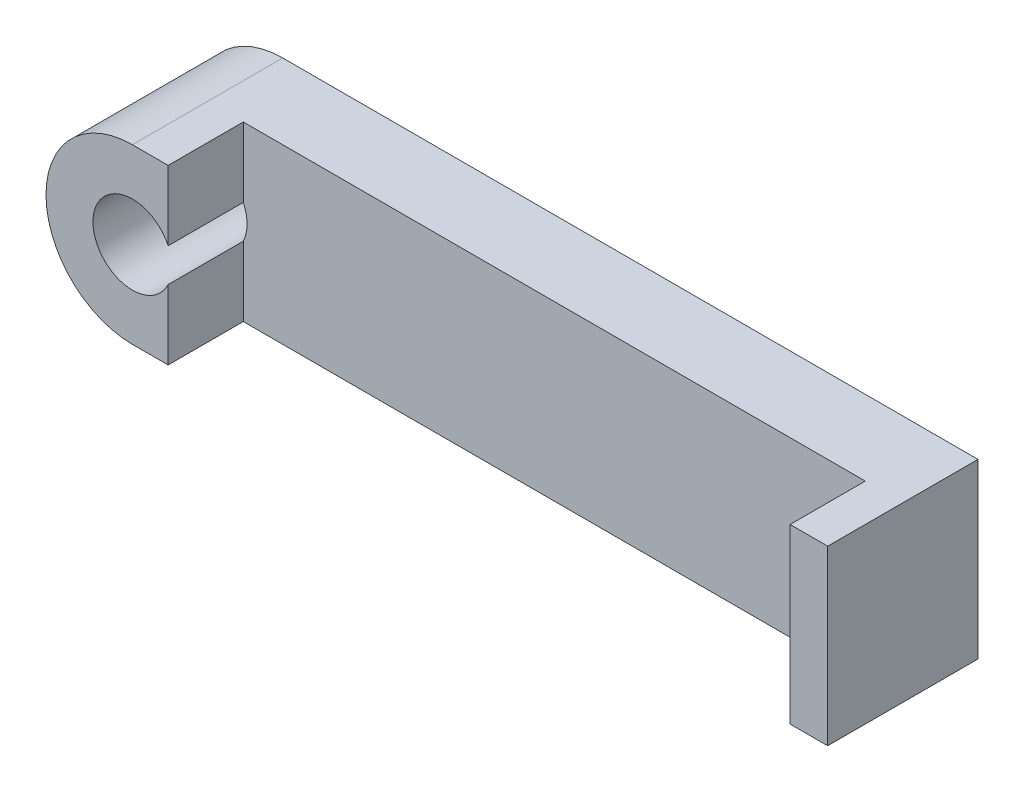
ISO-10303-21;
HEADER;
FILE_DESCRIPTION(('STEP AP214'),'2;1');
FILE_NAME('part.step','',(''),(''),'','','');
FILE_SCHEMA(('AUTOMOTIVE_DESIGN { 1 0 10303 214 1 1 1 1 }'));
ENDSEC;
DATA;
#1=APPLICATION_CONTEXT('core data for automotive mechanical design processes');
#2=APPLICATION_PROTOCOL_DEFINITION('international standard','automotive_design',2000,#1);
#3=PRODUCT_CONTEXT('',#1,'mechanical');
#4=PRODUCT('Part','Part','',(#3));
#5=PRODUCT_RELATED_PRODUCT_CATEGORY('part','',(#4));
#6=PRODUCT_DEFINITION_FORMATION('','',#4);
#7=PRODUCT_DEFINITION_CONTEXT('part definition',#1,'design');
#8=PRODUCT_DEFINITION('design','',#6,#7);
#9=PRODUCT_DEFINITION_SHAPE('','',#8);
#10=(LENGTH_UNIT() NAMED_UNIT(*) SI_UNIT(.MILLI.,.METRE.));
#11=(NAMED_UNIT(*) PLANE_ANGLE_UNIT() SI_UNIT($,.RADIAN.));
#12=(NAMED_UNIT(*) SI_UNIT($,.STERADIAN.) SOLID_ANGLE_UNIT());
#13=UNCERTAINTY_MEASURE_WITH_UNIT(LENGTH_MEASURE(1.E-05),#10,'distance_accuracy_value','');
#14=(GEOMETRIC_REPRESENTATION_CONTEXT(3) GLOBAL_UNCERTAINTY_ASSIGNED_CONTEXT((#13)) GLOBAL_UNIT_ASSIGNED_CONTEXT((#10,
#11,#12)) REPRESENTATION_CONTEXT('',''));
#15=CARTESIAN_POINT('',(0.,0.,0.));
#16=DIRECTION('',(0.,0.,1.));
#17=DIRECTION('',(1.,0.,0.));
#18=AXIS2_PLACEMENT_3D('',#15,#16,#17);
#19=CARTESIAN_POINT('',(0.,0.,4.));
#20=DIRECTION('',(0.,0.,1.));
#21=DIRECTION('',(1.,0.,0.));
#22=AXIS2_PLACEMENT_3D('',#19,#20,#21);
#23=PLANE('',#22);
#24=DIRECTION('',(0.,1.,0.));
#25=VECTOR('',#24,1.);
#26=CARTESIAN_POINT('',(1.9,4.6,4.));
#27=LINE('',#26,#25);
#28=CARTESIAN_POINT('',(1.9,0.894427190999917,4.));
#29=VERTEX_POINT('',#28);
#30=CARTESIAN_POINT('',(1.9,4.6,4.));
#31=VERTEX_POINT('',#30);
#32=EDGE_CURVE('E56',#29,#31,#27,.T.);
#33=ORIENTED_EDGE('',*,*,#32,.F.);
#34=CARTESIAN_POINT('',(0.,0.,4.));
#35=DIRECTION('',(0.,0.,1.));
#36=DIRECTION('',(1.,0.,0.));
#37=AXIS2_PLACEMENT_3D('',#34,#35,#36);
#38=CIRCLE('',#37,2.1);
#39=CARTESIAN_POINT('',(1.9,-0.894427190999916,4.));
#40=VERTEX_POINT('',#39);
#41=EDGE_CURVE('E179',#40,#29,#38,.T.);
#42=ORIENTED_EDGE('',*,*,#41,.F.);
#43=DIRECTION('',(0.,1.,0.));
#44=VECTOR('',#43,1.);
#45=CARTESIAN_POINT('',(1.9,-0.894427190999916,4.));
#46=LINE('',#45,#44);
#47=CARTESIAN_POINT('',(1.9,-4.6,4.));
#48=VERTEX_POINT('',#47);
#49=EDGE_CURVE('E138',#48,#40,#46,.T.);
#50=ORIENTED_EDGE('',*,*,#49,.F.);
#51=DIRECTION('',(1.,0.,0.));
#52=VECTOR('',#51,1.);
#53=CARTESIAN_POINT('',(37.,-4.6,4.));
#54=LINE('',#53,#52);
#55=CARTESIAN_POINT('',(35.,-4.6,4.));
#56=VERTEX_POINT('',#55);
#57=EDGE_CURVE('E183',#48,#56,#54,.T.);
#58=ORIENTED_EDGE('',*,*,#57,.T.);
#59=DIRECTION('',(0.,-1.,0.));
#60=VECTOR('',#59,1.);
#61=CARTESIAN_POINT('',(35.,4.6,4.));
#62=LINE('',#61,#60);
#63=CARTESIAN_POINT('',(35.,4.6,4.));
#64=VERTEX_POINT('',#63);
#65=EDGE_CURVE('E149',#64,#56,#62,.T.);
#66=ORIENTED_EDGE('',*,*,#65,.F.);
#67=DIRECTION('',(-1.,0.,0.));
#68=VECTOR('',#67,1.);
#69=CARTESIAN_POINT('',(0.,4.6,4.));
#70=LINE('',#69,#68);
#71=EDGE_CURVE('E61',#64,#31,#70,.T.);
#72=ORIENTED_EDGE('',*,*,#71,.T.);
#73=EDGE_LOOP('',(#33,#42,#50,#58,#66,#72));
#74=FACE_BOUND('',#73,.T.);
#75=ADVANCED_FACE('F41',(#74),#23,.T.);
#76=CARTESIAN_POINT('',(0.,0.,0.));
#77=DIRECTION('',(0.,0.,1.));
#78=DIRECTION('',(1.,0.,0.));
#79=AXIS2_PLACEMENT_3D('',#76,#77,#78);
#80=PLANE('',#79);
#81=CARTESIAN_POINT('',(0.,0.,0.));
#82=DIRECTION('',(0.,0.,1.));
#83=DIRECTION('',(1.,0.,0.));
#84=AXIS2_PLACEMENT_3D('',#81,#82,#83);
#85=CIRCLE('',#84,4.6);
#86=CARTESIAN_POINT('',(0.,4.6,0.));
#87=VERTEX_POINT('',#86);
#88=CARTESIAN_POINT('',(0.,-4.6,0.));
#89=VERTEX_POINT('',#88);
#90=EDGE_CURVE('E121',#87,#89,#85,.T.);
#91=ORIENTED_EDGE('',*,*,#90,.F.);
#92=DIRECTION('',(-1.,0.,0.));
#93=VECTOR('',#92,1.);
#94=CARTESIAN_POINT('',(0.,4.6,0.));
#95=LINE('',#94,#93);
#96=CARTESIAN_POINT('',(37.,4.6,0.));
#97=VERTEX_POINT('',#96);
#98=EDGE_CURVE('E185',#97,#87,#95,.T.);
#99=ORIENTED_EDGE('',*,*,#98,.F.);
#100=DIRECTION('',(0.,1.,0.));
#101=VECTOR('',#100,1.);
#102=CARTESIAN_POINT('',(37.,4.6,0.));
#103=LINE('',#102,#101);
#104=CARTESIAN_POINT('',(37.,-4.6,0.));
#105=VERTEX_POINT('',#104);
#106=EDGE_CURVE('E191',#105,#97,#103,.T.);
#107=ORIENTED_EDGE('',*,*,#106,.F.);
#108=DIRECTION('',(1.,0.,0.));
#109=VECTOR('',#108,1.);
#110=CARTESIAN_POINT('',(37.,-4.6,0.));
#111=LINE('',#110,#109);
#112=EDGE_CURVE('E189',#89,#105,#111,.T.);
#113=ORIENTED_EDGE('',*,*,#112,.F.);
#114=EDGE_LOOP('',(#91,#99,#107,#113));
#115=FACE_BOUND('',#114,.T.);
#116=CARTESIAN_POINT('',(0.,0.,0.));
#117=DIRECTION('',(0.,0.,1.));
#118=DIRECTION('',(1.,0.,0.));
#119=AXIS2_PLACEMENT_3D('',#116,#117,#118);
#120=CIRCLE('',#119,2.1);
#121=CARTESIAN_POINT('',(2.1,0.,0.));
#122=VERTEX_POINT('',#121);
#123=EDGE_CURVE('E160',#122,#122,#120,.T.);
#124=ORIENTED_EDGE('',*,*,#123,.T.);
#125=EDGE_LOOP('',(#124));
#126=FACE_BOUND('',#125,.T.);
#127=ADVANCED_FACE('F205',(#115,#126),#80,.F.);
#128=CARTESIAN_POINT('',(0.,0.,4.));
#129=DIRECTION('',(0.,0.,-1.));
#130=DIRECTION('',(-1.,0.,0.));
#131=AXIS2_PLACEMENT_3D('',#128,#129,#130);
#132=CYLINDRICAL_SURFACE('',#131,4.6);
#133=ORIENTED_EDGE('',*,*,#90,.T.);
#134=DIRECTION('',(0.,0.,-1.));
#135=VECTOR('',#134,1.);
#136=CARTESIAN_POINT('',(0.,-4.6,4.));
#137=LINE('',#136,#135);
#138=CARTESIAN_POINT('',(0.,-4.6,8.));
#139=VERTEX_POINT('',#138);
#140=EDGE_CURVE('E11',#139,#89,#137,.T.);
#141=ORIENTED_EDGE('',*,*,#140,.F.);
#142=CARTESIAN_POINT('',(0.,0.,8.));
#143=DIRECTION('',(0.,0.,1.));
#144=DIRECTION('',(1.,0.,0.));
#145=AXIS2_PLACEMENT_3D('',#142,#143,#144);
#146=CIRCLE('',#145,4.6);
#147=CARTESIAN_POINT('',(0.,4.6,8.));
#148=VERTEX_POINT('',#147);
#149=EDGE_CURVE('E119',#148,#139,#146,.T.);
#150=ORIENTED_EDGE('',*,*,#149,.F.);
#151=DIRECTION('',(0.,0.,-1.));
#152=VECTOR('',#151,1.);
#153=CARTESIAN_POINT('',(0.,4.6,4.));
#154=LINE('',#153,#152);
#155=EDGE_CURVE('E187',#148,#87,#154,.T.);
#156=ORIENTED_EDGE('',*,*,#155,.T.);
#157=EDGE_LOOP('',(#133,#141,#150,#156));
#158=FACE_BOUND('',#157,.T.);
#159=ADVANCED_FACE('F43',(#158),#132,.T.);
#160=CARTESIAN_POINT('',(37.,-4.6,4.));
#161=DIRECTION('',(0.,1.,0.));
#162=DIRECTION('',(0.,0.,1.));
#163=AXIS2_PLACEMENT_3D('',#160,#161,#162);
#164=PLANE('',#163);
#165=ORIENTED_EDGE('',*,*,#112,.T.);
#166=DIRECTION('',(0.,0.,-1.));
#167=VECTOR('',#166,1.);
#168=CARTESIAN_POINT('',(37.,-4.6,4.));
#169=LINE('',#168,#167);
#170=CARTESIAN_POINT('',(37.,-4.6,8.));
#171=VERTEX_POINT('',#170);
#172=EDGE_CURVE('E49',#171,#105,#169,.T.);
#173=ORIENTED_EDGE('',*,*,#172,.F.);
#174=DIRECTION('',(1.,0.,0.));
#175=VECTOR('',#174,1.);
#176=CARTESIAN_POINT('',(37.,-4.6,8.));
#177=LINE('',#176,#175);
#178=CARTESIAN_POINT('',(35.,-4.6,8.));
#179=VERTEX_POINT('',#178);
#180=EDGE_CURVE('E167',#179,#171,#177,.T.);
#181=ORIENTED_EDGE('',*,*,#180,.F.);
#182=DIRECTION('',(0.,0.,-1.));
#183=VECTOR('',#182,1.);
#184=CARTESIAN_POINT('',(35.,-4.6,8.));
#185=LINE('',#184,#183);
#186=EDGE_CURVE('E164',#179,#56,#185,.T.);
#187=ORIENTED_EDGE('',*,*,#186,.T.);
#188=ORIENTED_EDGE('',*,*,#57,.F.);
#189=DIRECTION('',(0.,0.,-1.));
#190=VECTOR('',#189,1.);
#191=CARTESIAN_POINT('',(1.9,-4.6,8.));
#192=LINE('',#191,#190);
#193=CARTESIAN_POINT('',(1.9,-4.6,8.));
#194=VERTEX_POINT('',#193);
#195=EDGE_CURVE('E128',#194,#48,#192,.T.);
#196=ORIENTED_EDGE('',*,*,#195,.F.);
#197=DIRECTION('',(1.,0.,0.));
#198=VECTOR('',#197,1.);
#199=CARTESIAN_POINT('',(0.,-4.6,8.));
#200=LINE('',#199,#198);
#201=EDGE_CURVE('E124',#139,#194,#200,.T.);
#202=ORIENTED_EDGE('',*,*,#201,.F.);
#203=ORIENTED_EDGE('',*,*,#140,.T.);
#204=EDGE_LOOP('',(#165,#173,#181,#187,#188,#196,#202,#203));
#205=FACE_BOUND('',#204,.T.);
#206=ADVANCED_FACE('F125',(#205),#164,.F.);
#207=CARTESIAN_POINT('',(37.,4.6,4.));
#208=DIRECTION('',(-1.,0.,0.));
#209=DIRECTION('',(0.,0.,1.));
#210=AXIS2_PLACEMENT_3D('',#207,#208,#209);
#211=PLANE('',#210);
#212=ORIENTED_EDGE('',*,*,#106,.T.);
#213=DIRECTION('',(0.,0.,-1.));
#214=VECTOR('',#213,1.);
#215=CARTESIAN_POINT('',(37.,4.6,4.));
#216=LINE('',#215,#214);
#217=CARTESIAN_POINT('',(37.,4.6,8.));
#218=VERTEX_POINT('',#217);
#219=EDGE_CURVE('E195',#218,#97,#216,.T.);
#220=ORIENTED_EDGE('',*,*,#219,.F.);
#221=DIRECTION('',(0.,1.,0.));
#222=VECTOR('',#221,1.);
#223=CARTESIAN_POINT('',(37.,4.6,8.));
#224=LINE('',#223,#222);
#225=EDGE_CURVE('E170',#171,#218,#224,.T.);
#226=ORIENTED_EDGE('',*,*,#225,.F.);
#227=ORIENTED_EDGE('',*,*,#172,.T.);
#228=EDGE_LOOP('',(#212,#220,#226,#227));
#229=FACE_BOUND('',#228,.T.);
#230=ADVANCED_FACE('F201',(#229),#211,.F.);
#231=CARTESIAN_POINT('',(0.,4.6,4.));
#232=DIRECTION('',(0.,-1.,0.));
#233=DIRECTION('',(0.,0.,-1.));
#234=AXIS2_PLACEMENT_3D('',#231,#232,#233);
#235=PLANE('',#234);
#236=ORIENTED_EDGE('',*,*,#98,.T.);
#237=ORIENTED_EDGE('',*,*,#155,.F.);
#238=DIRECTION('',(-1.,0.,0.));
#239=VECTOR('',#238,1.);
#240=CARTESIAN_POINT('',(0.,4.6,8.));
#241=LINE('',#240,#239);
#242=CARTESIAN_POINT('',(1.9,4.6,8.));
#243=VERTEX_POINT('',#242);
#244=EDGE_CURVE('E136',#243,#148,#241,.T.);
#245=ORIENTED_EDGE('',*,*,#244,.F.);
#246=DIRECTION('',(0.,0.,-1.));
#247=VECTOR('',#246,1.);
#248=CARTESIAN_POINT('',(1.9,4.6,8.));
#249=LINE('',#248,#247);
#250=EDGE_CURVE('E147',#243,#31,#249,.T.);
#251=ORIENTED_EDGE('',*,*,#250,.T.);
#252=ORIENTED_EDGE('',*,*,#71,.F.);
#253=DIRECTION('',(0.,0.,-1.));
#254=VECTOR('',#253,1.);
#255=CARTESIAN_POINT('',(35.,4.6,8.));
#256=LINE('',#255,#254);
#257=CARTESIAN_POINT('',(35.,4.6,8.));
#258=VERTEX_POINT('',#257);
#259=EDGE_CURVE('E161',#258,#64,#256,.T.);
#260=ORIENTED_EDGE('',*,*,#259,.F.);
#261=DIRECTION('',(-1.,0.,0.));
#262=VECTOR('',#261,1.);
#263=CARTESIAN_POINT('',(37.,4.6,8.));
#264=LINE('',#263,#262);
#265=EDGE_CURVE('E175',#218,#258,#264,.T.);
#266=ORIENTED_EDGE('',*,*,#265,.F.);
#267=ORIENTED_EDGE('',*,*,#219,.T.);
#268=EDGE_LOOP('',(#236,#237,#245,#251,#252,#260,#266,#267));
#269=FACE_BOUND('',#268,.T.);
#270=ADVANCED_FACE('F208',(#269),#235,.F.);
#271=CARTESIAN_POINT('',(0.,0.,4.));
#272=DIRECTION('',(0.,0.,-1.));
#273=DIRECTION('',(-1.,0.,0.));
#274=AXIS2_PLACEMENT_3D('',#271,#272,#273);
#275=CYLINDRICAL_SURFACE('',#274,2.1);
#276=ORIENTED_EDGE('',*,*,#41,.T.);
#277=DIRECTION('',(0.,0.,-1.));
#278=VECTOR('',#277,1.);
#279=CARTESIAN_POINT('',(1.9,0.894427190999917,8.));
#280=LINE('',#279,#278);
#281=CARTESIAN_POINT('',(1.9,0.894427190999917,8.));
#282=VERTEX_POINT('',#281);
#283=EDGE_CURVE('E153',#282,#29,#280,.T.);
#284=ORIENTED_EDGE('',*,*,#283,.F.);
#285=CARTESIAN_POINT('',(0.,0.,8.));
#286=DIRECTION('',(0.,0.,-1.));
#287=DIRECTION('',(1.,0.,0.));
#288=AXIS2_PLACEMENT_3D('',#285,#286,#287);
#289=CIRCLE('',#288,2.1);
#290=CARTESIAN_POINT('',(1.9,-0.894427190999916,8.));
#291=VERTEX_POINT('',#290);
#292=EDGE_CURVE('E142',#291,#282,#289,.T.);
#293=ORIENTED_EDGE('',*,*,#292,.F.);
#294=DIRECTION('',(0.,0.,-1.));
#295=VECTOR('',#294,1.);
#296=CARTESIAN_POINT('',(1.9,-0.894427190999916,8.));
#297=LINE('',#296,#295);
#298=EDGE_CURVE('E156',#291,#40,#297,.T.);
#299=ORIENTED_EDGE('',*,*,#298,.T.);
#300=EDGE_LOOP('',(#276,#284,#293,#299));
#301=FACE_BOUND('',#300,.T.);
#302=ORIENTED_EDGE('',*,*,#123,.F.);
#303=EDGE_LOOP('',(#302));
#304=FACE_BOUND('',#303,.T.);
#305=ADVANCED_FACE('F224',(#301,#304),#275,.F.);
#306=CARTESIAN_POINT('',(35.,4.6,8.));
#307=DIRECTION('',(1.,0.,0.));
#308=DIRECTION('',(0.,0.,-1.));
#309=AXIS2_PLACEMENT_3D('',#306,#307,#308);
#310=PLANE('',#309);
#311=ORIENTED_EDGE('',*,*,#65,.T.);
#312=ORIENTED_EDGE('',*,*,#186,.F.);
#313=DIRECTION('',(0.,-1.,0.));
#314=VECTOR('',#313,1.);
#315=CARTESIAN_POINT('',(35.,4.6,8.));
#316=LINE('',#315,#314);
#317=EDGE_CURVE('E173',#258,#179,#316,.T.);
#318=ORIENTED_EDGE('',*,*,#317,.F.);
#319=ORIENTED_EDGE('',*,*,#259,.T.);
#320=EDGE_LOOP('',(#311,#312,#318,#319));
#321=FACE_BOUND('',#320,.T.);
#322=ADVANCED_FACE('F216',(#321),#310,.F.);
#323=CARTESIAN_POINT('',(0.,0.,8.));
#324=DIRECTION('',(0.,0.,-1.));
#325=DIRECTION('',(-1.,0.,0.));
#326=AXIS2_PLACEMENT_3D('',#323,#324,#325);
#327=PLANE('',#326);
#328=ORIENTED_EDGE('',*,*,#225,.T.);
#329=ORIENTED_EDGE('',*,*,#265,.T.);
#330=ORIENTED_EDGE('',*,*,#317,.T.);
#331=ORIENTED_EDGE('',*,*,#180,.T.);
#332=EDGE_LOOP('',(#328,#329,#330,#331));
#333=FACE_BOUND('',#332,.T.);
#334=ADVANCED_FACE('F213',(#333),#327,.F.);
#335=CARTESIAN_POINT('',(1.9,-0.894427190999916,8.));
#336=DIRECTION('',(-1.,0.,0.));
#337=DIRECTION('',(0.,-1.,0.));
#338=AXIS2_PLACEMENT_3D('',#335,#336,#337);
#339=PLANE('',#338);
#340=ORIENTED_EDGE('',*,*,#49,.T.);
#341=ORIENTED_EDGE('',*,*,#298,.F.);
#342=DIRECTION('',(0.,1.,0.));
#343=VECTOR('',#342,1.);
#344=CARTESIAN_POINT('',(1.9,-0.894427190999916,8.));
#345=LINE('',#344,#343);
#346=EDGE_CURVE('E131',#194,#291,#345,.T.);
#347=ORIENTED_EDGE('',*,*,#346,.F.);
#348=ORIENTED_EDGE('',*,*,#195,.T.);
#349=EDGE_LOOP('',(#340,#341,#347,#348));
#350=FACE_BOUND('',#349,.T.);
#351=ADVANCED_FACE('F228',(#350),#339,.F.);
#352=CARTESIAN_POINT('',(1.9,4.6,8.));
#353=DIRECTION('',(-1.,0.,0.));
#354=DIRECTION('',(0.,-1.,0.));
#355=AXIS2_PLACEMENT_3D('',#352,#353,#354);
#356=PLANE('',#355);
#357=ORIENTED_EDGE('',*,*,#32,.T.);
#358=ORIENTED_EDGE('',*,*,#250,.F.);
#359=DIRECTION('',(0.,1.,0.));
#360=VECTOR('',#359,1.);
#361=CARTESIAN_POINT('',(1.9,4.6,8.));
#362=LINE('',#361,#360);
#363=EDGE_CURVE('E144',#282,#243,#362,.T.);
#364=ORIENTED_EDGE('',*,*,#363,.F.);
#365=ORIENTED_EDGE('',*,*,#283,.T.);
#366=EDGE_LOOP('',(#357,#358,#364,#365));
#367=FACE_BOUND('',#366,.T.);
#368=ADVANCED_FACE('F220',(#367),#356,.F.);
#369=CARTESIAN_POINT('',(0.,0.,8.));
#370=DIRECTION('',(0.,0.,1.));
#371=DIRECTION('',(1.,0.,0.));
#372=AXIS2_PLACEMENT_3D('',#369,#370,#371);
#373=PLANE('',#372);
#374=ORIENTED_EDGE('',*,*,#149,.T.);
#375=ORIENTED_EDGE('',*,*,#201,.T.);
#376=ORIENTED_EDGE('',*,*,#346,.T.);
#377=ORIENTED_EDGE('',*,*,#292,.T.);
#378=ORIENTED_EDGE('',*,*,#363,.T.);
#379=ORIENTED_EDGE('',*,*,#244,.T.);
#380=EDGE_LOOP('',(#374,#375,#376,#377,#378,#379));
#381=FACE_BOUND('',#380,.T.);
#382=ADVANCED_FACE('F134',(#381),#373,.T.);
#383=CLOSED_SHELL('',(#75,#127,#159,#206,#230,#270,#305,#322,#334,#351,#368,#382));
#384=MANIFOLD_SOLID_BREP('B2',#383);
#385=ADVANCED_BREP_SHAPE_REPRESENTATION('',(#18,#384),#14);
#386=SHAPE_DEFINITION_REPRESENTATION(#9,#385);
ENDSEC;
END-ISO-10303-21;
